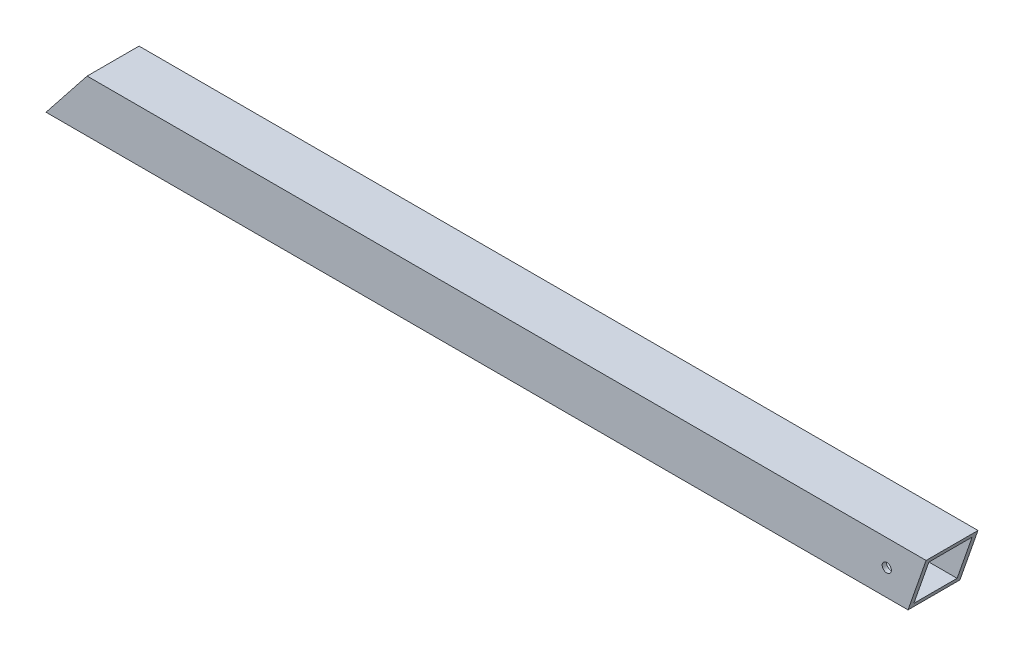
ISO-10303-21;
HEADER;
FILE_DESCRIPTION(('STEP AP214'),'2;1');
FILE_NAME('part.step','',(''),(''),'','','');
FILE_SCHEMA(('AUTOMOTIVE_DESIGN { 1 0 10303 214 1 1 1 1 }'));
ENDSEC;
DATA;
#1=APPLICATION_CONTEXT('core data for automotive mechanical design processes');
#2=APPLICATION_PROTOCOL_DEFINITION('international standard','automotive_design',2000,#1);
#3=PRODUCT_CONTEXT('',#1,'mechanical');
#4=PRODUCT('Part','Part','',(#3));
#5=PRODUCT_RELATED_PRODUCT_CATEGORY('part','',(#4));
#6=PRODUCT_DEFINITION_FORMATION('','',#4);
#7=PRODUCT_DEFINITION_CONTEXT('part definition',#1,'design');
#8=PRODUCT_DEFINITION('design','',#6,#7);
#9=PRODUCT_DEFINITION_SHAPE('','',#8);
#10=(LENGTH_UNIT() NAMED_UNIT(*) SI_UNIT(.MILLI.,.METRE.));
#11=(NAMED_UNIT(*) PLANE_ANGLE_UNIT() SI_UNIT($,.RADIAN.));
#12=(NAMED_UNIT(*) SI_UNIT($,.STERADIAN.) SOLID_ANGLE_UNIT());
#13=UNCERTAINTY_MEASURE_WITH_UNIT(LENGTH_MEASURE(1.E-05),#10,'distance_accuracy_value','');
#14=(GEOMETRIC_REPRESENTATION_CONTEXT(3) GLOBAL_UNCERTAINTY_ASSIGNED_CONTEXT((#13)) GLOBAL_UNIT_ASSIGNED_CONTEXT((#10,
#11,#12)) REPRESENTATION_CONTEXT('',''));
#15=CARTESIAN_POINT('',(0.,0.,0.));
#16=DIRECTION('',(0.,0.,1.));
#17=DIRECTION('',(1.,0.,0.));
#18=AXIS2_PLACEMENT_3D('',#15,#16,#17);
#19=CARTESIAN_POINT('',(-179.532569829183,38.0999999999999,-38.1));
#20=DIRECTION('',(0.,-1.,0.));
#21=DIRECTION('',(1.,0.,0.));
#22=AXIS2_PLACEMENT_3D('',#19,#20,#21);
#23=PLANE('',#22);
#24=DIRECTION('',(0.,0.,-1.));
#25=VECTOR('',#24,1.);
#26=CARTESIAN_POINT('',(-795.362359180678,38.0999999999999,-38.1));
#27=LINE('',#26,#25);
#28=CARTESIAN_POINT('',(-795.362359180678,38.0999999999999,0.));
#29=VERTEX_POINT('',#28);
#30=CARTESIAN_POINT('',(-795.362359180678,38.0999999999999,-38.1));
#31=VERTEX_POINT('',#30);
#32=EDGE_CURVE('E94',#29,#31,#27,.T.);
#33=ORIENTED_EDGE('',*,*,#32,.F.);
#34=DIRECTION('',(-1.,0.,0.));
#35=VECTOR('',#34,1.);
#36=CARTESIAN_POINT('',(-179.532569829183,38.0999999999999,0.));
#37=LINE('',#36,#35);
#38=CARTESIAN_POINT('',(-179.532569829183,38.0999999999999,0.));
#39=VERTEX_POINT('',#38);
#40=EDGE_CURVE('E129',#39,#29,#37,.T.);
#41=ORIENTED_EDGE('',*,*,#40,.F.);
#42=DIRECTION('',(0.,0.,1.));
#43=VECTOR('',#42,1.);
#44=CARTESIAN_POINT('',(-179.532569829183,38.0999999999999,-38.1));
#45=LINE('',#44,#43);
#46=CARTESIAN_POINT('',(-179.532569829183,38.0999999999999,-38.1));
#47=VERTEX_POINT('',#46);
#48=EDGE_CURVE('E116',#47,#39,#45,.T.);
#49=ORIENTED_EDGE('',*,*,#48,.F.);
#50=DIRECTION('',(-1.,0.,0.));
#51=VECTOR('',#50,1.);
#52=CARTESIAN_POINT('',(-179.532569829183,38.0999999999999,-38.1));
#53=LINE('',#52,#51);
#54=EDGE_CURVE('E110',#47,#31,#53,.T.);
#55=ORIENTED_EDGE('',*,*,#54,.T.);
#56=EDGE_LOOP('',(#33,#41,#49,#55));
#57=FACE_BOUND('',#56,.T.);
#58=ADVANCED_FACE('F33',(#57),#23,.F.);
#59=CARTESIAN_POINT('',(-179.532569829183,0.,0.));
#60=DIRECTION('',(0.,0.,-1.));
#61=DIRECTION('',(-0.783658095702396,0.621192392934826,0.));
#62=AXIS2_PLACEMENT_3D('',#59,#60,#61);
#63=PLANE('',#62);
#64=CARTESIAN_POINT('',(-208.392089703772,19.05,0.));
#65=DIRECTION('',(0.,0.,1.));
#66=DIRECTION('',(0.783658095702396,-0.621192392934826,0.));
#67=AXIS2_PLACEMENT_3D('',#64,#65,#66);
#68=CIRCLE('',#67,3.3782);
#69=CARTESIAN_POINT('',(-205.74473592487,16.9514878581876,0.));
#70=VERTEX_POINT('',#69);
#71=EDGE_CURVE('E177',#70,#70,#68,.T.);
#72=ORIENTED_EDGE('',*,*,#71,.F.);
#73=EDGE_LOOP('',(#72));
#74=FACE_BOUND('',#73,.T.);
#75=DIRECTION('',(-0.621192392934826,-0.783658095702396,0.));
#76=VECTOR('',#75,1.);
#77=CARTESIAN_POINT('',(-814.123126999009,14.4325698291832,0.));
#78=LINE('',#77,#76);
#79=CARTESIAN_POINT('',(-825.563578692873,1.11022302462516E-13,0.));
#80=VERTEX_POINT('',#79);
#81=EDGE_CURVE('E48',#29,#80,#78,.T.);
#82=ORIENTED_EDGE('',*,*,#81,.T.);
#83=DIRECTION('',(-1.,0.,0.));
#84=VECTOR('',#83,1.);
#85=CARTESIAN_POINT('',(-179.532569829183,0.,0.));
#86=LINE('',#85,#84);
#87=CARTESIAN_POINT('',(-192.80160957836,0.,0.));
#88=VERTEX_POINT('',#87);
#89=EDGE_CURVE('E119',#88,#80,#86,.T.);
#90=ORIENTED_EDGE('',*,*,#89,.F.);
#91=DIRECTION('',(-0.328893527070392,-0.944367009086615,0.));
#92=VECTOR('',#91,1.);
#93=CARTESIAN_POINT('',(-191.366284914592,4.12131327686938,0.));
#94=LINE('',#93,#92);
#95=EDGE_CURVE('E121',#39,#88,#94,.T.);
#96=ORIENTED_EDGE('',*,*,#95,.F.);
#97=ORIENTED_EDGE('',*,*,#40,.T.);
#98=EDGE_LOOP('',(#82,#90,#96,#97));
#99=FACE_BOUND('',#98,.T.);
#100=ADVANCED_FACE('F183',(#74,#99),#63,.F.);
#101=CARTESIAN_POINT('',(-179.532569829183,0.,-38.1));
#102=DIRECTION('',(0.,1.,0.));
#103=DIRECTION('',(-1.,0.,0.));
#104=AXIS2_PLACEMENT_3D('',#101,#102,#103);
#105=PLANE('',#104);
#106=DIRECTION('',(0.,0.,1.));
#107=VECTOR('',#106,1.);
#108=CARTESIAN_POINT('',(-825.563578692873,1.11022302462516E-13,-38.1));
#109=LINE('',#108,#107);
#110=CARTESIAN_POINT('',(-825.563578692873,1.11022302462516E-13,-38.1));
#111=VERTEX_POINT('',#110);
#112=EDGE_CURVE('E103',#111,#80,#109,.T.);
#113=ORIENTED_EDGE('',*,*,#112,.F.);
#114=DIRECTION('',(-1.,0.,0.));
#115=VECTOR('',#114,1.);
#116=CARTESIAN_POINT('',(-179.532569829183,0.,-38.1));
#117=LINE('',#116,#115);
#118=CARTESIAN_POINT('',(-192.80160957836,0.,-38.1));
#119=VERTEX_POINT('',#118);
#120=EDGE_CURVE('E112',#119,#111,#117,.T.);
#121=ORIENTED_EDGE('',*,*,#120,.F.);
#122=DIRECTION('',(0.,0.,-1.));
#123=VECTOR('',#122,1.);
#124=CARTESIAN_POINT('',(-192.80160957836,0.,-38.1));
#125=LINE('',#124,#123);
#126=EDGE_CURVE('E153',#88,#119,#125,.T.);
#127=ORIENTED_EDGE('',*,*,#126,.F.);
#128=ORIENTED_EDGE('',*,*,#89,.T.);
#129=EDGE_LOOP('',(#113,#121,#127,#128));
#130=FACE_BOUND('',#129,.T.);
#131=ADVANCED_FACE('F186',(#130),#105,.F.);
#132=CARTESIAN_POINT('',(-179.532569829183,0.,-38.1));
#133=DIRECTION('',(0.,0.,1.));
#134=DIRECTION('',(0.783658095702396,-0.621192392934826,0.));
#135=AXIS2_PLACEMENT_3D('',#132,#133,#134);
#136=PLANE('',#135);
#137=CARTESIAN_POINT('',(-208.392089703772,19.05,-38.1));
#138=DIRECTION('',(0.,0.,1.));
#139=DIRECTION('',(0.783658095702396,-0.621192392934826,0.));
#140=AXIS2_PLACEMENT_3D('',#137,#138,#139);
#141=CIRCLE('',#140,3.3782);
#142=CARTESIAN_POINT('',(-205.74473592487,16.9514878581876,-38.1));
#143=VERTEX_POINT('',#142);
#144=EDGE_CURVE('E174',#143,#143,#141,.T.);
#145=ORIENTED_EDGE('',*,*,#144,.T.);
#146=EDGE_LOOP('',(#145));
#147=FACE_BOUND('',#146,.T.);
#148=DIRECTION('',(-0.621192392934826,-0.783658095702396,0.));
#149=VECTOR('',#148,1.);
#150=CARTESIAN_POINT('',(-814.123126999009,14.4325698291832,-38.1));
#151=LINE('',#150,#149);
#152=EDGE_CURVE('E97',#31,#111,#151,.T.);
#153=ORIENTED_EDGE('',*,*,#152,.F.);
#154=ORIENTED_EDGE('',*,*,#54,.F.);
#155=DIRECTION('',(0.328893527070392,0.944367009086615,0.));
#156=VECTOR('',#155,1.);
#157=CARTESIAN_POINT('',(-191.366284914592,4.12131327686938,-38.1));
#158=LINE('',#157,#156);
#159=EDGE_CURVE('E156',#119,#47,#158,.T.);
#160=ORIENTED_EDGE('',*,*,#159,.F.);
#161=ORIENTED_EDGE('',*,*,#120,.T.);
#162=EDGE_LOOP('',(#153,#154,#160,#161));
#163=FACE_BOUND('',#162,.T.);
#164=ADVANCED_FACE('F108',(#147,#163),#136,.F.);
#165=CARTESIAN_POINT('',(-179.532569829183,38.1000000000001,0.));
#166=DIRECTION('',(0.944367009086614,-0.328893527070392,0.));
#167=DIRECTION('',(0.328893527070392,0.944367009086615,0.));
#168=AXIS2_PLACEMENT_3D('',#165,#166,#167);
#169=PLANE('',#168);
#170=DIRECTION('',(0.,0.,1.));
#171=VECTOR('',#170,1.);
#172=CARTESIAN_POINT('',(-180.638323141615,34.9250000000002,-34.925));
#173=LINE('',#172,#171);
#174=CARTESIAN_POINT('',(-180.638323141615,34.9250000000002,-34.925));
#175=VERTEX_POINT('',#174);
#176=CARTESIAN_POINT('',(-180.638323141615,34.9250000000002,-3.175));
#177=VERTEX_POINT('',#176);
#178=EDGE_CURVE('E158',#175,#177,#173,.T.);
#179=ORIENTED_EDGE('',*,*,#178,.F.);
#180=DIRECTION('',(0.328893527070392,0.944367009086615,0.));
#181=VECTOR('',#180,1.);
#182=CARTESIAN_POINT('',(-190.380141990808,6.95287050379678,-34.925));
#183=LINE('',#182,#181);
#184=CARTESIAN_POINT('',(-191.695856265929,3.17500000000004,-34.925));
#185=VERTEX_POINT('',#184);
#186=EDGE_CURVE('E161',#185,#175,#183,.T.);
#187=ORIENTED_EDGE('',*,*,#186,.F.);
#188=DIRECTION('',(0.,0.,-1.));
#189=VECTOR('',#188,1.);
#190=CARTESIAN_POINT('',(-191.695856265929,3.17500000000004,-34.925));
#191=LINE('',#190,#189);
#192=CARTESIAN_POINT('',(-191.695856265929,3.17500000000004,-3.175));
#193=VERTEX_POINT('',#192);
#194=EDGE_CURVE('E163',#193,#185,#191,.T.);
#195=ORIENTED_EDGE('',*,*,#194,.F.);
#196=DIRECTION('',(-0.328893527070392,-0.944367009086615,0.));
#197=VECTOR('',#196,1.);
#198=CARTESIAN_POINT('',(-190.380141990808,6.95287050379678,-3.175));
#199=LINE('',#198,#197);
#200=EDGE_CURVE('E41',#177,#193,#199,.T.);
#201=ORIENTED_EDGE('',*,*,#200,.F.);
#202=EDGE_LOOP('',(#179,#187,#195,#201));
#203=FACE_BOUND('',#202,.T.);
#204=ORIENTED_EDGE('',*,*,#159,.T.);
#205=ORIENTED_EDGE('',*,*,#48,.T.);
#206=ORIENTED_EDGE('',*,*,#95,.T.);
#207=ORIENTED_EDGE('',*,*,#126,.T.);
#208=EDGE_LOOP('',(#204,#205,#206,#207));
#209=FACE_BOUND('',#208,.T.);
#210=ADVANCED_FACE('F190',(#203,#209),#169,.T.);
#211=CARTESIAN_POINT('',(-179.532569829183,34.9250000000002,-34.925));
#212=DIRECTION('',(0.,-1.,0.));
#213=DIRECTION('',(1.,0.,0.));
#214=AXIS2_PLACEMENT_3D('',#211,#212,#213);
#215=PLANE('',#214);
#216=DIRECTION('',(-1.,0.,0.));
#217=VECTOR('',#216,1.);
#218=CARTESIAN_POINT('',(-179.532569829183,34.9250000000002,-3.175));
#219=LINE('',#218,#217);
#220=CARTESIAN_POINT('',(-797.879127473361,34.9250000000002,-3.17500000000002));
#221=VERTEX_POINT('',#220);
#222=EDGE_CURVE('E131',#177,#221,#219,.T.);
#223=ORIENTED_EDGE('',*,*,#222,.T.);
#224=DIRECTION('',(0.,0.,-1.));
#225=VECTOR('',#224,1.);
#226=CARTESIAN_POINT('',(-797.879127473361,34.9250000000002,-34.925));
#227=LINE('',#226,#225);
#228=CARTESIAN_POINT('',(-797.879127473361,34.9250000000002,-34.925));
#229=VERTEX_POINT('',#228);
#230=EDGE_CURVE('E11',#221,#229,#227,.T.);
#231=ORIENTED_EDGE('',*,*,#230,.T.);
#232=DIRECTION('',(-1.,0.,0.));
#233=VECTOR('',#232,1.);
#234=CARTESIAN_POINT('',(-179.532569829183,34.9250000000002,-34.925));
#235=LINE('',#234,#233);
#236=EDGE_CURVE('E124',#175,#229,#235,.T.);
#237=ORIENTED_EDGE('',*,*,#236,.F.);
#238=ORIENTED_EDGE('',*,*,#178,.T.);
#239=EDGE_LOOP('',(#223,#231,#237,#238));
#240=FACE_BOUND('',#239,.T.);
#241=ADVANCED_FACE('F192',(#240),#215,.T.);
#242=CARTESIAN_POINT('',(-179.532569829183,3.17500000000004,-34.925));
#243=DIRECTION('',(0.,0.,1.));
#244=DIRECTION('',(0.783658095702396,-0.621192392934826,0.));
#245=AXIS2_PLACEMENT_3D('',#242,#243,#244);
#246=PLANE('',#245);
#247=CARTESIAN_POINT('',(-208.392089703772,19.05,-34.925));
#248=DIRECTION('',(0.,0.,1.));
#249=DIRECTION('',(0.783658095702396,-0.621192392934826,0.));
#250=AXIS2_PLACEMENT_3D('',#247,#248,#249);
#251=CIRCLE('',#250,3.3782);
#252=CARTESIAN_POINT('',(-205.74473592487,16.9514878581876,-34.925));
#253=VERTEX_POINT('',#252);
#254=EDGE_CURVE('E36',#253,#253,#251,.T.);
#255=ORIENTED_EDGE('',*,*,#254,.F.);
#256=EDGE_LOOP('',(#255));
#257=FACE_BOUND('',#256,.T.);
#258=ORIENTED_EDGE('',*,*,#236,.T.);
#259=DIRECTION('',(-0.621192392934826,-0.783658095702396,0.));
#260=VECTOR('',#259,1.);
#261=CARTESIAN_POINT('',(-574.727542301505,316.439307447572,-34.925));
#262=LINE('',#261,#260);
#263=CARTESIAN_POINT('',(-823.04681040019,3.17500000000004,-34.925));
#264=VERTEX_POINT('',#263);
#265=EDGE_CURVE('E56',#229,#264,#262,.T.);
#266=ORIENTED_EDGE('',*,*,#265,.T.);
#267=DIRECTION('',(-1.,0.,0.));
#268=VECTOR('',#267,1.);
#269=CARTESIAN_POINT('',(-179.532569829183,3.17500000000004,-34.925));
#270=LINE('',#269,#268);
#271=EDGE_CURVE('E137',#185,#264,#270,.T.);
#272=ORIENTED_EDGE('',*,*,#271,.F.);
#273=ORIENTED_EDGE('',*,*,#186,.T.);
#274=EDGE_LOOP('',(#258,#266,#272,#273));
#275=FACE_BOUND('',#274,.T.);
#276=ADVANCED_FACE('F199',(#257,#275),#246,.T.);
#277=CARTESIAN_POINT('',(-179.532569829183,3.17500000000004,-34.925));
#278=DIRECTION('',(0.,1.,0.));
#279=DIRECTION('',(-1.,0.,0.));
#280=AXIS2_PLACEMENT_3D('',#277,#278,#279);
#281=PLANE('',#280);
#282=ORIENTED_EDGE('',*,*,#271,.T.);
#283=DIRECTION('',(0.,0.,1.));
#284=VECTOR('',#283,1.);
#285=CARTESIAN_POINT('',(-823.04681040019,3.17500000000004,-34.925));
#286=LINE('',#285,#284);
#287=CARTESIAN_POINT('',(-823.04681040019,3.17500000000004,-3.17500000000001));
#288=VERTEX_POINT('',#287);
#289=EDGE_CURVE('E168',#264,#288,#286,.T.);
#290=ORIENTED_EDGE('',*,*,#289,.T.);
#291=DIRECTION('',(-1.,0.,0.));
#292=VECTOR('',#291,1.);
#293=CARTESIAN_POINT('',(-179.532569829183,3.17500000000004,-3.175));
#294=LINE('',#293,#292);
#295=EDGE_CURVE('E142',#193,#288,#294,.T.);
#296=ORIENTED_EDGE('',*,*,#295,.F.);
#297=ORIENTED_EDGE('',*,*,#194,.T.);
#298=EDGE_LOOP('',(#282,#290,#296,#297));
#299=FACE_BOUND('',#298,.T.);
#300=ADVANCED_FACE('F242',(#299),#281,.T.);
#301=CARTESIAN_POINT('',(-179.532569829183,3.17500000000004,-3.175));
#302=DIRECTION('',(0.,0.,-1.));
#303=DIRECTION('',(-0.783658095702396,0.621192392934826,0.));
#304=AXIS2_PLACEMENT_3D('',#301,#302,#303);
#305=PLANE('',#304);
#306=CARTESIAN_POINT('',(-208.392089703772,19.05,-3.175));
#307=DIRECTION('',(0.,0.,-1.));
#308=DIRECTION('',(-0.783658095702396,0.621192392934826,0.));
#309=AXIS2_PLACEMENT_3D('',#306,#307,#308);
#310=CIRCLE('',#309,3.3782);
#311=CARTESIAN_POINT('',(-211.039443482674,21.1485121418124,-3.175));
#312=VERTEX_POINT('',#311);
#313=EDGE_CURVE('E113',#312,#312,#310,.T.);
#314=ORIENTED_EDGE('',*,*,#313,.F.);
#315=EDGE_LOOP('',(#314));
#316=FACE_BOUND('',#315,.T.);
#317=ORIENTED_EDGE('',*,*,#295,.T.);
#318=DIRECTION('',(0.621192392934826,0.783658095702396,0.));
#319=VECTOR('',#318,1.);
#320=CARTESIAN_POINT('',(-574.727542301505,316.439307447572,-3.17500000000003));
#321=LINE('',#320,#319);
#322=EDGE_CURVE('E104',#288,#221,#321,.T.);
#323=ORIENTED_EDGE('',*,*,#322,.T.);
#324=ORIENTED_EDGE('',*,*,#222,.F.);
#325=ORIENTED_EDGE('',*,*,#200,.T.);
#326=EDGE_LOOP('',(#317,#323,#324,#325));
#327=FACE_BOUND('',#326,.T.);
#328=ADVANCED_FACE('F252',(#316,#327),#305,.T.);
#329=CARTESIAN_POINT('',(-814.123126999009,14.4325698291832,-38.1));
#330=DIRECTION('',(-0.783658095702396,0.621192392934826,0.));
#331=DIRECTION('',(0.,0.,1.));
#332=AXIS2_PLACEMENT_3D('',#329,#330,#331);
#333=PLANE('',#332);
#334=ORIENTED_EDGE('',*,*,#289,.F.);
#335=ORIENTED_EDGE('',*,*,#265,.F.);
#336=ORIENTED_EDGE('',*,*,#230,.F.);
#337=ORIENTED_EDGE('',*,*,#322,.F.);
#338=EDGE_LOOP('',(#334,#335,#336,#337));
#339=FACE_BOUND('',#338,.T.);
#340=ORIENTED_EDGE('',*,*,#112,.T.);
#341=ORIENTED_EDGE('',*,*,#81,.F.);
#342=ORIENTED_EDGE('',*,*,#32,.T.);
#343=ORIENTED_EDGE('',*,*,#152,.T.);
#344=EDGE_LOOP('',(#340,#341,#342,#343));
#345=FACE_BOUND('',#344,.T.);
#346=ADVANCED_FACE('F96',(#339,#345),#333,.T.);
#347=CARTESIAN_POINT('',(-208.392089703772,19.05,0.));
#348=DIRECTION('',(0.,0.,1.));
#349=DIRECTION('',(0.783658095702396,-0.621192392934826,0.));
#350=AXIS2_PLACEMENT_3D('',#347,#348,#349);
#351=CYLINDRICAL_SURFACE('',#350,3.3782);
#352=ORIENTED_EDGE('',*,*,#254,.T.);
#353=EDGE_LOOP('',(#352));
#354=FACE_BOUND('',#353,.T.);
#355=ORIENTED_EDGE('',*,*,#144,.F.);
#356=EDGE_LOOP('',(#355));
#357=FACE_BOUND('',#356,.T.);
#358=ADVANCED_FACE('F269',(#354,#357),#351,.F.);
#359=ORIENTED_EDGE('',*,*,#313,.T.);
#360=EDGE_LOOP('',(#359));
#361=FACE_BOUND('',#360,.T.);
#362=ORIENTED_EDGE('',*,*,#71,.T.);
#363=EDGE_LOOP('',(#362));
#364=FACE_BOUND('',#363,.T.);
#365=ADVANCED_FACE('F181',(#361,#364),#351,.F.);
#366=CLOSED_SHELL('',(#58,#100,#131,#164,#210,#241,#276,#300,#328,#346,#358,#365));
#367=MANIFOLD_SOLID_BREP('B2',#366);
#368=ADVANCED_BREP_SHAPE_REPRESENTATION('',(#18,#367),#14);
#369=SHAPE_DEFINITION_REPRESENTATION(#9,#368);
ENDSEC;
END-ISO-10303-21;
